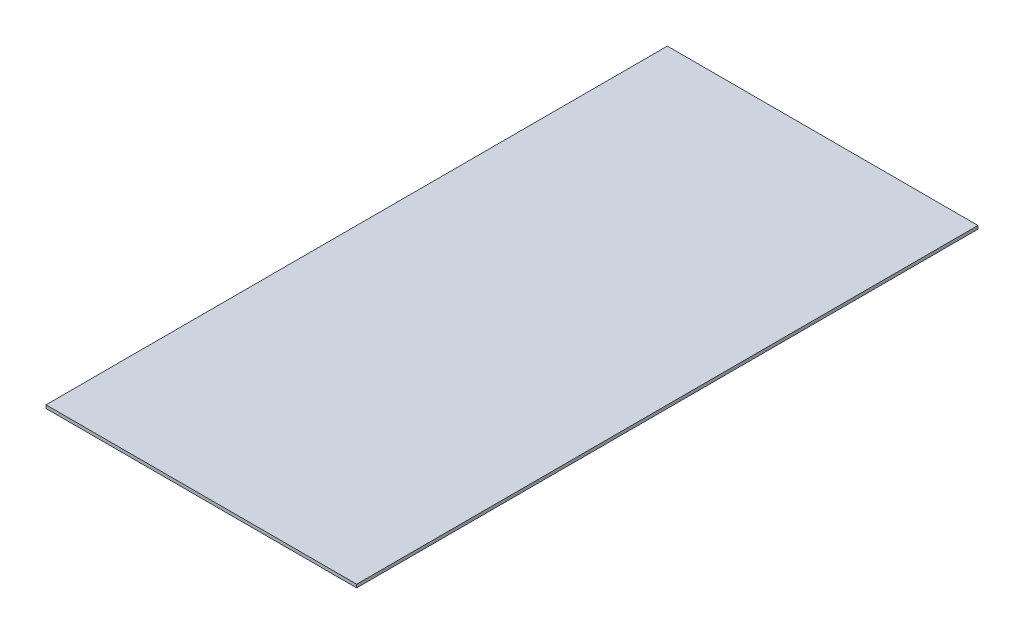
ISO-10303-21;
HEADER;
FILE_DESCRIPTION(('STEP AP214'),'2;1');
FILE_NAME('part.step','',(''),(''),'','','');
FILE_SCHEMA(('AUTOMOTIVE_DESIGN { 1 0 10303 214 1 1 1 1 }'));
ENDSEC;
DATA;
#1=APPLICATION_CONTEXT('core data for automotive mechanical design processes');
#2=APPLICATION_PROTOCOL_DEFINITION('international standard','automotive_design',2000,#1);
#3=PRODUCT_CONTEXT('',#1,'mechanical');
#4=PRODUCT('Part','Part','',(#3));
#5=PRODUCT_RELATED_PRODUCT_CATEGORY('part','',(#4));
#6=PRODUCT_DEFINITION_FORMATION('','',#4);
#7=PRODUCT_DEFINITION_CONTEXT('part definition',#1,'design');
#8=PRODUCT_DEFINITION('design','',#6,#7);
#9=PRODUCT_DEFINITION_SHAPE('','',#8);
#10=(LENGTH_UNIT() NAMED_UNIT(*) SI_UNIT(.MILLI.,.METRE.));
#11=(NAMED_UNIT(*) PLANE_ANGLE_UNIT() SI_UNIT($,.RADIAN.));
#12=(NAMED_UNIT(*) SI_UNIT($,.STERADIAN.) SOLID_ANGLE_UNIT());
#13=UNCERTAINTY_MEASURE_WITH_UNIT(LENGTH_MEASURE(1.E-05),#10,'distance_accuracy_value','');
#14=(GEOMETRIC_REPRESENTATION_CONTEXT(3) GLOBAL_UNCERTAINTY_ASSIGNED_CONTEXT((#13)) GLOBAL_UNIT_ASSIGNED_CONTEXT((#10,
#11,#12)) REPRESENTATION_CONTEXT('',''));
#15=CARTESIAN_POINT('',(0.,0.,0.));
#16=DIRECTION('',(0.,0.,1.));
#17=DIRECTION('',(1.,0.,0.));
#18=AXIS2_PLACEMENT_3D('',#15,#16,#17);
#19=CARTESIAN_POINT('',(152.4,3.175,-304.8));
#20=DIRECTION('',(-1.,0.,0.));
#21=DIRECTION('',(0.,0.,1.));
#22=AXIS2_PLACEMENT_3D('',#19,#20,#21);
#23=PLANE('',#22);
#24=DIRECTION('',(0.,0.,-1.));
#25=VECTOR('',#24,1.);
#26=CARTESIAN_POINT('',(152.4,0.,-304.8));
#27=LINE('',#26,#25);
#28=CARTESIAN_POINT('',(152.4,0.,304.8));
#29=VERTEX_POINT('',#28);
#30=CARTESIAN_POINT('',(152.4,0.,-304.8));
#31=VERTEX_POINT('',#30);
#32=EDGE_CURVE('E97',#29,#31,#27,.T.);
#33=ORIENTED_EDGE('',*,*,#32,.T.);
#34=DIRECTION('',(0.,-1.,0.));
#35=VECTOR('',#34,1.);
#36=CARTESIAN_POINT('',(152.4,3.175,-304.8));
#37=LINE('',#36,#35);
#38=CARTESIAN_POINT('',(152.4,3.175,-304.8));
#39=VERTEX_POINT('',#38);
#40=EDGE_CURVE('E11',#39,#31,#37,.T.);
#41=ORIENTED_EDGE('',*,*,#40,.F.);
#42=DIRECTION('',(0.,0.,-1.));
#43=VECTOR('',#42,1.);
#44=CARTESIAN_POINT('',(152.4,3.175,-304.8));
#45=LINE('',#44,#43);
#46=CARTESIAN_POINT('',(152.4,3.175,304.8));
#47=VERTEX_POINT('',#46);
#48=EDGE_CURVE('E85',#47,#39,#45,.T.);
#49=ORIENTED_EDGE('',*,*,#48,.F.);
#50=DIRECTION('',(0.,-1.,0.));
#51=VECTOR('',#50,1.);
#52=CARTESIAN_POINT('',(152.4,3.175,304.8));
#53=LINE('',#52,#51);
#54=EDGE_CURVE('E93',#47,#29,#53,.T.);
#55=ORIENTED_EDGE('',*,*,#54,.T.);
#56=EDGE_LOOP('',(#33,#41,#49,#55));
#57=FACE_BOUND('',#56,.T.);
#58=ADVANCED_FACE('F34',(#57),#23,.F.);
#59=CARTESIAN_POINT('',(-152.4,3.175,-304.8));
#60=DIRECTION('',(0.,0.,1.));
#61=DIRECTION('',(1.,0.,0.));
#62=AXIS2_PLACEMENT_3D('',#59,#60,#61);
#63=PLANE('',#62);
#64=DIRECTION('',(-1.,0.,0.));
#65=VECTOR('',#64,1.);
#66=CARTESIAN_POINT('',(-152.4,0.,-304.8));
#67=LINE('',#66,#65);
#68=CARTESIAN_POINT('',(-152.4,0.,-304.8));
#69=VERTEX_POINT('',#68);
#70=EDGE_CURVE('E89',#31,#69,#67,.T.);
#71=ORIENTED_EDGE('',*,*,#70,.T.);
#72=DIRECTION('',(0.,-1.,0.));
#73=VECTOR('',#72,1.);
#74=CARTESIAN_POINT('',(-152.4,3.175,-304.8));
#75=LINE('',#74,#73);
#76=CARTESIAN_POINT('',(-152.4,3.175,-304.8));
#77=VERTEX_POINT('',#76);
#78=EDGE_CURVE('E42',#77,#69,#75,.T.);
#79=ORIENTED_EDGE('',*,*,#78,.F.);
#80=DIRECTION('',(-1.,0.,0.));
#81=VECTOR('',#80,1.);
#82=CARTESIAN_POINT('',(-152.4,3.175,-304.8));
#83=LINE('',#82,#81);
#84=EDGE_CURVE('E80',#39,#77,#83,.T.);
#85=ORIENTED_EDGE('',*,*,#84,.F.);
#86=ORIENTED_EDGE('',*,*,#40,.T.);
#87=EDGE_LOOP('',(#71,#79,#85,#86));
#88=FACE_BOUND('',#87,.T.);
#89=ADVANCED_FACE('F88',(#88),#63,.F.);
#90=CARTESIAN_POINT('',(-152.4,3.175,-304.8));
#91=DIRECTION('',(1.,0.,0.));
#92=DIRECTION('',(0.,0.,-1.));
#93=AXIS2_PLACEMENT_3D('',#90,#91,#92);
#94=PLANE('',#93);
#95=DIRECTION('',(0.,0.,1.));
#96=VECTOR('',#95,1.);
#97=CARTESIAN_POINT('',(-152.4,0.,-304.8));
#98=LINE('',#97,#96);
#99=CARTESIAN_POINT('',(-152.4,0.,304.8));
#100=VERTEX_POINT('',#99);
#101=EDGE_CURVE('E67',#69,#100,#98,.T.);
#102=ORIENTED_EDGE('',*,*,#101,.T.);
#103=DIRECTION('',(0.,-1.,0.));
#104=VECTOR('',#103,1.);
#105=CARTESIAN_POINT('',(-152.4,3.175,304.8));
#106=LINE('',#105,#104);
#107=CARTESIAN_POINT('',(-152.4,3.175,304.8));
#108=VERTEX_POINT('',#107);
#109=EDGE_CURVE('E90',#108,#100,#106,.T.);
#110=ORIENTED_EDGE('',*,*,#109,.F.);
#111=DIRECTION('',(0.,0.,1.));
#112=VECTOR('',#111,1.);
#113=CARTESIAN_POINT('',(-152.4,3.175,-304.8));
#114=LINE('',#113,#112);
#115=EDGE_CURVE('E83',#77,#108,#114,.T.);
#116=ORIENTED_EDGE('',*,*,#115,.F.);
#117=ORIENTED_EDGE('',*,*,#78,.T.);
#118=EDGE_LOOP('',(#102,#110,#116,#117));
#119=FACE_BOUND('',#118,.T.);
#120=ADVANCED_FACE('F91',(#119),#94,.F.);
#121=CARTESIAN_POINT('',(-152.4,3.175,304.8));
#122=DIRECTION('',(0.,0.,-1.));
#123=DIRECTION('',(-1.,0.,0.));
#124=AXIS2_PLACEMENT_3D('',#121,#122,#123);
#125=PLANE('',#124);
#126=DIRECTION('',(1.,0.,0.));
#127=VECTOR('',#126,1.);
#128=CARTESIAN_POINT('',(-152.4,0.,304.8));
#129=LINE('',#128,#127);
#130=EDGE_CURVE('E73',#100,#29,#129,.T.);
#131=ORIENTED_EDGE('',*,*,#130,.T.);
#132=ORIENTED_EDGE('',*,*,#54,.F.);
#133=DIRECTION('',(1.,0.,0.));
#134=VECTOR('',#133,1.);
#135=CARTESIAN_POINT('',(-152.4,3.175,304.8));
#136=LINE('',#135,#134);
#137=EDGE_CURVE('E50',#108,#47,#136,.T.);
#138=ORIENTED_EDGE('',*,*,#137,.F.);
#139=ORIENTED_EDGE('',*,*,#109,.T.);
#140=EDGE_LOOP('',(#131,#132,#138,#139));
#141=FACE_BOUND('',#140,.T.);
#142=ADVANCED_FACE('F104',(#141),#125,.F.);
#143=CARTESIAN_POINT('',(0.,3.175,0.));
#144=DIRECTION('',(0.,1.,0.));
#145=DIRECTION('',(0.,0.,1.));
#146=AXIS2_PLACEMENT_3D('',#143,#144,#145);
#147=PLANE('',#146);
#148=ORIENTED_EDGE('',*,*,#48,.T.);
#149=ORIENTED_EDGE('',*,*,#84,.T.);
#150=ORIENTED_EDGE('',*,*,#115,.T.);
#151=ORIENTED_EDGE('',*,*,#137,.T.);
#152=EDGE_LOOP('',(#148,#149,#150,#151));
#153=FACE_BOUND('',#152,.T.);
#154=ADVANCED_FACE('F81',(#153),#147,.T.);
#155=CARTESIAN_POINT('',(0.,0.,0.));
#156=DIRECTION('',(0.,1.,0.));
#157=DIRECTION('',(0.,0.,1.));
#158=AXIS2_PLACEMENT_3D('',#155,#156,#157);
#159=PLANE('',#158);
#160=ORIENTED_EDGE('',*,*,#32,.F.);
#161=ORIENTED_EDGE('',*,*,#130,.F.);
#162=ORIENTED_EDGE('',*,*,#101,.F.);
#163=ORIENTED_EDGE('',*,*,#70,.F.);
#164=EDGE_LOOP('',(#160,#161,#162,#163));
#165=FACE_BOUND('',#164,.T.);
#166=ADVANCED_FACE('F107',(#165),#159,.F.);
#167=CLOSED_SHELL('',(#58,#89,#120,#142,#154,#166));
#168=MANIFOLD_SOLID_BREP('B2',#167);
#169=ADVANCED_BREP_SHAPE_REPRESENTATION('',(#18,#168),#14);
#170=SHAPE_DEFINITION_REPRESENTATION(#9,#169);
ENDSEC;
END-ISO-10303-21;
